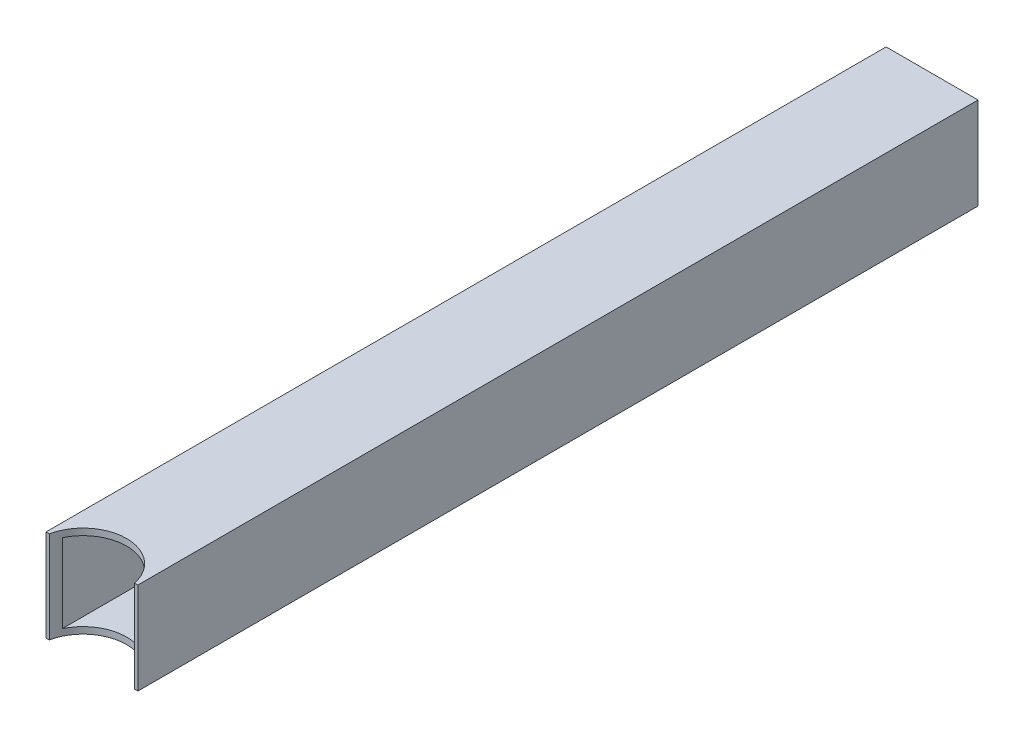
ISO-10303-21;
HEADER;
FILE_DESCRIPTION(('STEP AP214'),'2;1');
FILE_NAME('part.step','',(''),(''),'','','');
FILE_SCHEMA(('AUTOMOTIVE_DESIGN { 1 0 10303 214 1 1 1 1 }'));
ENDSEC;
DATA;
#1=APPLICATION_CONTEXT('core data for automotive mechanical design processes');
#2=APPLICATION_PROTOCOL_DEFINITION('international standard','automotive_design',2000,#1);
#3=PRODUCT_CONTEXT('',#1,'mechanical');
#4=PRODUCT('Part','Part','',(#3));
#5=PRODUCT_RELATED_PRODUCT_CATEGORY('part','',(#4));
#6=PRODUCT_DEFINITION_FORMATION('','',#4);
#7=PRODUCT_DEFINITION_CONTEXT('part definition',#1,'design');
#8=PRODUCT_DEFINITION('design','',#6,#7);
#9=PRODUCT_DEFINITION_SHAPE('','',#8);
#10=(LENGTH_UNIT() NAMED_UNIT(*) SI_UNIT(.MILLI.,.METRE.));
#11=(NAMED_UNIT(*) PLANE_ANGLE_UNIT() SI_UNIT($,.RADIAN.));
#12=(NAMED_UNIT(*) SI_UNIT($,.STERADIAN.) SOLID_ANGLE_UNIT());
#13=UNCERTAINTY_MEASURE_WITH_UNIT(LENGTH_MEASURE(1.E-05),#10,'distance_accuracy_value','');
#14=(GEOMETRIC_REPRESENTATION_CONTEXT(3) GLOBAL_UNCERTAINTY_ASSIGNED_CONTEXT((#13)) GLOBAL_UNIT_ASSIGNED_CONTEXT((#10,
#11,#12)) REPRESENTATION_CONTEXT('',''));
#15=CARTESIAN_POINT('',(0.,0.,0.));
#16=DIRECTION('',(0.,0.,1.));
#17=DIRECTION('',(1.,0.,0.));
#18=AXIS2_PLACEMENT_3D('',#15,#16,#17);
#19=CARTESIAN_POINT('',(682.625,0.,450.85));
#20=DIRECTION('',(0.,0.,1.));
#21=DIRECTION('',(1.,0.,0.));
#22=AXIS2_PLACEMENT_3D('',#19,#20,#21);
#23=PLANE('',#22);
#24=DIRECTION('',(0.,1.,0.));
#25=VECTOR('',#24,1.);
#26=CARTESIAN_POINT('',(660.4,0.,450.85));
#27=LINE('',#26,#25);
#28=CARTESIAN_POINT('',(660.4,-793.75,450.85));
#29=VERTEX_POINT('',#28);
#30=CARTESIAN_POINT('',(660.4,-838.2,450.85));
#31=VERTEX_POINT('',#30);
#32=EDGE_CURVE('E109',#29,#31,#27,.F.);
#33=ORIENTED_EDGE('',*,*,#32,.T.);
#34=DIRECTION('',(1.,0.,0.));
#35=VECTOR('',#34,1.);
#36=CARTESIAN_POINT('',(682.625,-838.2,450.85));
#37=LINE('',#36,#35);
#38=CARTESIAN_POINT('',(661.989942452225,-838.2,450.85));
#39=VERTEX_POINT('',#38);
#40=EDGE_CURVE('E116',#31,#39,#37,.T.);
#41=ORIENTED_EDGE('',*,*,#40,.T.);
#42=DIRECTION('',(0.,1.,0.));
#43=VECTOR('',#42,1.);
#44=CARTESIAN_POINT('',(661.989942452225,-793.748,450.85));
#45=LINE('',#44,#43);
#46=CARTESIAN_POINT('',(661.989942452225,-793.75,450.85));
#47=VERTEX_POINT('',#46);
#48=EDGE_CURVE('E114',#39,#47,#45,.T.);
#49=ORIENTED_EDGE('',*,*,#48,.T.);
#50=DIRECTION('',(1.,0.,0.));
#51=VECTOR('',#50,1.);
#52=CARTESIAN_POINT('',(682.625,-793.75,450.85));
#53=LINE('',#52,#51);
#54=EDGE_CURVE('E127',#47,#29,#53,.F.);
#55=ORIENTED_EDGE('',*,*,#54,.T.);
#56=EDGE_LOOP('',(#33,#41,#49,#55));
#57=FACE_BOUND('',#56,.T.);
#58=ADVANCED_FACE('F14',(#57),#23,.T.);
#59=CARTESIAN_POINT('',(682.625,-835.025,450.85));
#60=DIRECTION('',(0.,-1.,0.));
#61=DIRECTION('',(0.,0.,-1.));
#62=AXIS2_PLACEMENT_3D('',#59,#60,#61);
#63=PLANE('',#62);
#64=CARTESIAN_POINT('',(682.625,-835.025,455.168));
#65=DIRECTION('',(0.,1.,0.));
#66=DIRECTION('',(0.,0.,1.));
#67=AXIS2_PLACEMENT_3D('',#64,#65,#66);
#68=CIRCLE('',#67,21.082);
#69=CARTESIAN_POINT('',(663.575,-835.025,446.137594472007));
#70=VERTEX_POINT('',#69);
#71=CARTESIAN_POINT('',(701.675,-835.025,446.137594472008));
#72=VERTEX_POINT('',#71);
#73=EDGE_CURVE('E107',#70,#72,#68,.F.);
#74=ORIENTED_EDGE('',*,*,#73,.T.);
#75=DIRECTION('',(0.,0.,1.));
#76=VECTOR('',#75,1.);
#77=CARTESIAN_POINT('',(701.675,-835.025,450.85));
#78=LINE('',#77,#76);
#79=CARTESIAN_POINT('',(701.675,-835.025,44.45));
#80=VERTEX_POINT('',#79);
#81=EDGE_CURVE('E119',#72,#80,#78,.F.);
#82=ORIENTED_EDGE('',*,*,#81,.T.);
#83=DIRECTION('',(1.,0.,0.));
#84=VECTOR('',#83,1.);
#85=CARTESIAN_POINT('',(682.625,-835.025,44.45));
#86=LINE('',#85,#84);
#87=CARTESIAN_POINT('',(663.575,-835.025,44.45));
#88=VERTEX_POINT('',#87);
#89=EDGE_CURVE('E140',#80,#88,#86,.F.);
#90=ORIENTED_EDGE('',*,*,#89,.T.);
#91=DIRECTION('',(0.,0.,1.));
#92=VECTOR('',#91,1.);
#93=CARTESIAN_POINT('',(663.575,-835.025,450.85));
#94=LINE('',#93,#92);
#95=EDGE_CURVE('E97',#70,#88,#94,.F.);
#96=ORIENTED_EDGE('',*,*,#95,.F.);
#97=EDGE_LOOP('',(#74,#82,#90,#96));
#98=FACE_BOUND('',#97,.T.);
#99=ADVANCED_FACE('F312',(#98),#63,.F.);
#100=CARTESIAN_POINT('',(663.575,0.,450.85));
#101=DIRECTION('',(1.,0.,0.));
#102=DIRECTION('',(0.,1.,0.));
#103=AXIS2_PLACEMENT_3D('',#100,#101,#102);
#104=PLANE('',#103);
#105=DIRECTION('',(0.,1.,0.));
#106=VECTOR('',#105,1.);
#107=CARTESIAN_POINT('',(663.575,0.,44.45));
#108=LINE('',#107,#106);
#109=CARTESIAN_POINT('',(663.575,-796.925,44.45));
#110=VERTEX_POINT('',#109);
#111=EDGE_CURVE('E95',#88,#110,#108,.T.);
#112=ORIENTED_EDGE('',*,*,#111,.T.);
#113=DIRECTION('',(0.,0.,1.));
#114=VECTOR('',#113,1.);
#115=CARTESIAN_POINT('',(663.575,-796.925,450.85));
#116=LINE('',#115,#114);
#117=CARTESIAN_POINT('',(663.575,-796.925,446.137594472008));
#118=VERTEX_POINT('',#117);
#119=EDGE_CURVE('E88',#118,#110,#116,.F.);
#120=ORIENTED_EDGE('',*,*,#119,.F.);
#121=DIRECTION('',(0.,1.,0.));
#122=VECTOR('',#121,1.);
#123=CARTESIAN_POINT('',(663.575,-793.748,446.137594472008));
#124=LINE('',#123,#122);
#125=EDGE_CURVE('E92',#118,#70,#124,.F.);
#126=ORIENTED_EDGE('',*,*,#125,.T.);
#127=ORIENTED_EDGE('',*,*,#95,.T.);
#128=EDGE_LOOP('',(#112,#120,#126,#127));
#129=FACE_BOUND('',#128,.T.);
#130=ADVANCED_FACE('F89',(#129),#104,.T.);
#131=CARTESIAN_POINT('',(663.575,-796.925,450.85));
#132=DIRECTION('',(0.,-1.,0.));
#133=DIRECTION('',(1.,0.,0.));
#134=AXIS2_PLACEMENT_3D('',#131,#132,#133);
#135=PLANE('',#134);
#136=DIRECTION('',(1.,0.,0.));
#137=VECTOR('',#136,1.);
#138=CARTESIAN_POINT('',(682.625,-796.925,44.45));
#139=LINE('',#138,#137);
#140=CARTESIAN_POINT('',(701.675,-796.925,44.45));
#141=VERTEX_POINT('',#140);
#142=EDGE_CURVE('E137',#110,#141,#139,.T.);
#143=ORIENTED_EDGE('',*,*,#142,.T.);
#144=DIRECTION('',(0.,0.,1.));
#145=VECTOR('',#144,1.);
#146=CARTESIAN_POINT('',(701.675,-796.925,450.85));
#147=LINE('',#146,#145);
#148=CARTESIAN_POINT('',(701.675,-796.925,446.137594472008));
#149=VERTEX_POINT('',#148);
#150=EDGE_CURVE('E82',#141,#149,#147,.T.);
#151=ORIENTED_EDGE('',*,*,#150,.T.);
#152=CARTESIAN_POINT('',(682.625,-796.925,455.168));
#153=DIRECTION('',(0.,1.,0.));
#154=DIRECTION('',(0.,0.,1.));
#155=AXIS2_PLACEMENT_3D('',#152,#153,#154);
#156=CIRCLE('',#155,21.082);
#157=EDGE_CURVE('E17',#149,#118,#156,.T.);
#158=ORIENTED_EDGE('',*,*,#157,.T.);
#159=ORIENTED_EDGE('',*,*,#119,.T.);
#160=EDGE_LOOP('',(#143,#151,#158,#159));
#161=FACE_BOUND('',#160,.T.);
#162=ADVANCED_FACE('F100',(#161),#135,.T.);
#163=CARTESIAN_POINT('',(701.675,0.,450.85));
#164=DIRECTION('',(1.,0.,0.));
#165=DIRECTION('',(0.,1.,0.));
#166=AXIS2_PLACEMENT_3D('',#163,#164,#165);
#167=PLANE('',#166);
#168=DIRECTION('',(0.,1.,0.));
#169=VECTOR('',#168,1.);
#170=CARTESIAN_POINT('',(701.675,-793.748,446.137594472008));
#171=LINE('',#170,#169);
#172=EDGE_CURVE('E103',#72,#149,#171,.T.);
#173=ORIENTED_EDGE('',*,*,#172,.T.);
#174=ORIENTED_EDGE('',*,*,#150,.F.);
#175=DIRECTION('',(0.,1.,0.));
#176=VECTOR('',#175,1.);
#177=CARTESIAN_POINT('',(701.675,0.,44.45));
#178=LINE('',#177,#176);
#179=EDGE_CURVE('E133',#141,#80,#178,.F.);
#180=ORIENTED_EDGE('',*,*,#179,.T.);
#181=ORIENTED_EDGE('',*,*,#81,.F.);
#182=EDGE_LOOP('',(#173,#174,#180,#181));
#183=FACE_BOUND('',#182,.T.);
#184=ADVANCED_FACE('F289',(#183),#167,.F.);
#185=CARTESIAN_POINT('',(682.625,-793.748,455.168));
#186=DIRECTION('',(0.,1.,0.));
#187=DIRECTION('',(0.,0.,1.));
#188=AXIS2_PLACEMENT_3D('',#185,#186,#187);
#189=CYLINDRICAL_SURFACE('',#188,21.082);
#190=ORIENTED_EDGE('',*,*,#125,.F.);
#191=ORIENTED_EDGE('',*,*,#157,.F.);
#192=ORIENTED_EDGE('',*,*,#172,.F.);
#193=ORIENTED_EDGE('',*,*,#73,.F.);
#194=EDGE_LOOP('',(#190,#191,#192,#193));
#195=FACE_BOUND('',#194,.T.);
#196=CARTESIAN_POINT('',(682.625,-838.2,455.168));
#197=DIRECTION('',(0.,1.,0.));
#198=DIRECTION('',(0.,0.,1.));
#199=AXIS2_PLACEMENT_3D('',#196,#197,#198);
#200=CIRCLE('',#199,21.082);
#201=CARTESIAN_POINT('',(703.260057547776,-838.2,450.85));
#202=VERTEX_POINT('',#201);
#203=EDGE_CURVE('E159',#202,#39,#200,.T.);
#204=ORIENTED_EDGE('',*,*,#203,.F.);
#205=DIRECTION('',(0.,1.,0.));
#206=VECTOR('',#205,1.);
#207=CARTESIAN_POINT('',(703.260057547776,0.,450.85));
#208=LINE('',#207,#206);
#209=CARTESIAN_POINT('',(703.260057547776,-793.75,450.85));
#210=VERTEX_POINT('',#209);
#211=EDGE_CURVE('E172',#210,#202,#208,.F.);
#212=ORIENTED_EDGE('',*,*,#211,.F.);
#213=CARTESIAN_POINT('',(682.625,-793.75,455.168));
#214=DIRECTION('',(0.,1.,0.));
#215=DIRECTION('',(0.,0.,1.));
#216=AXIS2_PLACEMENT_3D('',#213,#214,#215);
#217=CIRCLE('',#216,21.082);
#218=EDGE_CURVE('E170',#210,#47,#217,.T.);
#219=ORIENTED_EDGE('',*,*,#218,.T.);
#220=ORIENTED_EDGE('',*,*,#48,.F.);
#221=EDGE_LOOP('',(#204,#212,#219,#220));
#222=FACE_BOUND('',#221,.T.);
#223=ADVANCED_FACE('F104',(#195,#222),#189,.F.);
#224=CARTESIAN_POINT('',(660.4,0.,450.85));
#225=DIRECTION('',(1.,0.,0.));
#226=DIRECTION('',(0.,1.,0.));
#227=AXIS2_PLACEMENT_3D('',#224,#225,#226);
#228=PLANE('',#227);
#229=DIRECTION('',(0.,0.,-1.));
#230=VECTOR('',#229,1.);
#231=CARTESIAN_POINT('',(660.4,-838.2,450.85));
#232=LINE('',#231,#230);
#233=CARTESIAN_POINT('',(660.4,-838.2,44.45));
#234=VERTEX_POINT('',#233);
#235=EDGE_CURVE('E155',#31,#234,#232,.T.);
#236=ORIENTED_EDGE('',*,*,#235,.F.);
#237=ORIENTED_EDGE('',*,*,#32,.F.);
#238=DIRECTION('',(0.,0.,1.));
#239=VECTOR('',#238,1.);
#240=CARTESIAN_POINT('',(660.4,-793.75,450.85));
#241=LINE('',#240,#239);
#242=CARTESIAN_POINT('',(660.4,-793.75,44.45));
#243=VERTEX_POINT('',#242);
#244=EDGE_CURVE('E136',#29,#243,#241,.F.);
#245=ORIENTED_EDGE('',*,*,#244,.T.);
#246=DIRECTION('',(0.,1.,0.));
#247=VECTOR('',#246,1.);
#248=CARTESIAN_POINT('',(660.4,0.,44.45));
#249=LINE('',#248,#247);
#250=EDGE_CURVE('E142',#243,#234,#249,.F.);
#251=ORIENTED_EDGE('',*,*,#250,.T.);
#252=EDGE_LOOP('',(#236,#237,#245,#251));
#253=FACE_BOUND('',#252,.T.);
#254=ADVANCED_FACE('F225',(#253),#228,.F.);
#255=CARTESIAN_POINT('',(682.625,0.,44.45));
#256=DIRECTION('',(0.,0.,1.));
#257=DIRECTION('',(1.,0.,0.));
#258=AXIS2_PLACEMENT_3D('',#255,#256,#257);
#259=PLANE('',#258);
#260=ORIENTED_EDGE('',*,*,#142,.F.);
#261=ORIENTED_EDGE('',*,*,#111,.F.);
#262=ORIENTED_EDGE('',*,*,#89,.F.);
#263=ORIENTED_EDGE('',*,*,#179,.F.);
#264=EDGE_LOOP('',(#260,#261,#262,#263));
#265=FACE_BOUND('',#264,.T.);
#266=DIRECTION('',(1.,0.,0.));
#267=VECTOR('',#266,1.);
#268=CARTESIAN_POINT('',(682.625,-838.2,44.45));
#269=LINE('',#268,#267);
#270=CARTESIAN_POINT('',(704.85,-838.2,44.45));
#271=VERTEX_POINT('',#270);
#272=EDGE_CURVE('E158',#234,#271,#269,.T.);
#273=ORIENTED_EDGE('',*,*,#272,.F.);
#274=ORIENTED_EDGE('',*,*,#250,.F.);
#275=DIRECTION('',(1.,0.,0.));
#276=VECTOR('',#275,1.);
#277=CARTESIAN_POINT('',(663.575,-793.75,44.45));
#278=LINE('',#277,#276);
#279=CARTESIAN_POINT('',(704.85,-793.75,44.45));
#280=VERTEX_POINT('',#279);
#281=EDGE_CURVE('E164',#243,#280,#278,.T.);
#282=ORIENTED_EDGE('',*,*,#281,.T.);
#283=DIRECTION('',(0.,1.,0.));
#284=VECTOR('',#283,1.);
#285=CARTESIAN_POINT('',(704.85,0.,44.45));
#286=LINE('',#285,#284);
#287=EDGE_CURVE('E203',#271,#280,#286,.T.);
#288=ORIENTED_EDGE('',*,*,#287,.F.);
#289=EDGE_LOOP('',(#273,#274,#282,#288));
#290=FACE_BOUND('',#289,.T.);
#291=ADVANCED_FACE('F226',(#265,#290),#259,.F.);
#292=CARTESIAN_POINT('',(663.575,-793.75,450.85));
#293=DIRECTION('',(0.,-1.,0.));
#294=DIRECTION('',(1.,0.,0.));
#295=AXIS2_PLACEMENT_3D('',#292,#293,#294);
#296=PLANE('',#295);
#297=DIRECTION('',(1.,0.,0.));
#298=VECTOR('',#297,1.);
#299=CARTESIAN_POINT('',(682.625,-793.75,450.85));
#300=LINE('',#299,#298);
#301=CARTESIAN_POINT('',(704.85,-793.75,450.85));
#302=VERTEX_POINT('',#301);
#303=EDGE_CURVE('E169',#302,#210,#300,.F.);
#304=ORIENTED_EDGE('',*,*,#303,.F.);
#305=DIRECTION('',(0.,0.,1.));
#306=VECTOR('',#305,1.);
#307=CARTESIAN_POINT('',(704.85,-793.75,450.85));
#308=LINE('',#307,#306);
#309=EDGE_CURVE('E192',#280,#302,#308,.T.);
#310=ORIENTED_EDGE('',*,*,#309,.F.);
#311=ORIENTED_EDGE('',*,*,#281,.F.);
#312=ORIENTED_EDGE('',*,*,#244,.F.);
#313=ORIENTED_EDGE('',*,*,#54,.F.);
#314=ORIENTED_EDGE('',*,*,#218,.F.);
#315=EDGE_LOOP('',(#304,#310,#311,#312,#313,#314));
#316=FACE_BOUND('',#315,.T.);
#317=ADVANCED_FACE('F220',(#316),#296,.F.);
#318=CARTESIAN_POINT('',(682.625,0.,450.85));
#319=DIRECTION('',(0.,0.,1.));
#320=DIRECTION('',(1.,0.,0.));
#321=AXIS2_PLACEMENT_3D('',#318,#319,#320);
#322=PLANE('',#321);
#323=DIRECTION('',(0.,1.,0.));
#324=VECTOR('',#323,1.);
#325=CARTESIAN_POINT('',(704.85,0.,450.85));
#326=LINE('',#325,#324);
#327=CARTESIAN_POINT('',(704.85,-838.2,450.85));
#328=VERTEX_POINT('',#327);
#329=EDGE_CURVE('E23',#302,#328,#326,.F.);
#330=ORIENTED_EDGE('',*,*,#329,.F.);
#331=ORIENTED_EDGE('',*,*,#303,.T.);
#332=ORIENTED_EDGE('',*,*,#211,.T.);
#333=DIRECTION('',(1.,0.,0.));
#334=VECTOR('',#333,1.);
#335=CARTESIAN_POINT('',(682.625,-838.2,450.85));
#336=LINE('',#335,#334);
#337=EDGE_CURVE('E32',#328,#202,#336,.F.);
#338=ORIENTED_EDGE('',*,*,#337,.F.);
#339=EDGE_LOOP('',(#330,#331,#332,#338));
#340=FACE_BOUND('',#339,.T.);
#341=ADVANCED_FACE('F218',(#340),#322,.T.);
#342=CARTESIAN_POINT('',(682.625,-838.2,450.85));
#343=DIRECTION('',(0.,-1.,0.));
#344=DIRECTION('',(0.,0.,-1.));
#345=AXIS2_PLACEMENT_3D('',#342,#343,#344);
#346=PLANE('',#345);
#347=DIRECTION('',(0.,0.,1.));
#348=VECTOR('',#347,1.);
#349=CARTESIAN_POINT('',(704.85,-838.2,450.85));
#350=LINE('',#349,#348);
#351=EDGE_CURVE('E9',#328,#271,#350,.F.);
#352=ORIENTED_EDGE('',*,*,#351,.F.);
#353=ORIENTED_EDGE('',*,*,#337,.T.);
#354=ORIENTED_EDGE('',*,*,#203,.T.);
#355=ORIENTED_EDGE('',*,*,#40,.F.);
#356=ORIENTED_EDGE('',*,*,#235,.T.);
#357=ORIENTED_EDGE('',*,*,#272,.T.);
#358=EDGE_LOOP('',(#352,#353,#354,#355,#356,#357));
#359=FACE_BOUND('',#358,.T.);
#360=ADVANCED_FACE('F214',(#359),#346,.T.);
#361=CARTESIAN_POINT('',(704.85,0.,450.85));
#362=DIRECTION('',(1.,0.,0.));
#363=DIRECTION('',(0.,1.,0.));
#364=AXIS2_PLACEMENT_3D('',#361,#362,#363);
#365=PLANE('',#364);
#366=ORIENTED_EDGE('',*,*,#329,.T.);
#367=ORIENTED_EDGE('',*,*,#351,.T.);
#368=ORIENTED_EDGE('',*,*,#287,.T.);
#369=ORIENTED_EDGE('',*,*,#309,.T.);
#370=EDGE_LOOP('',(#366,#367,#368,#369));
#371=FACE_BOUND('',#370,.T.);
#372=ADVANCED_FACE('F217',(#371),#365,.T.);
#373=CLOSED_SHELL('',(#58,#99,#130,#162,#184,#223,#254,#291,#317,#341,#360,#372));
#374=MANIFOLD_SOLID_BREP('B1',#373);
#375=ADVANCED_BREP_SHAPE_REPRESENTATION('',(#18,#374),#14);
#376=SHAPE_DEFINITION_REPRESENTATION(#9,#375);
ENDSEC;
END-ISO-10303-21;
